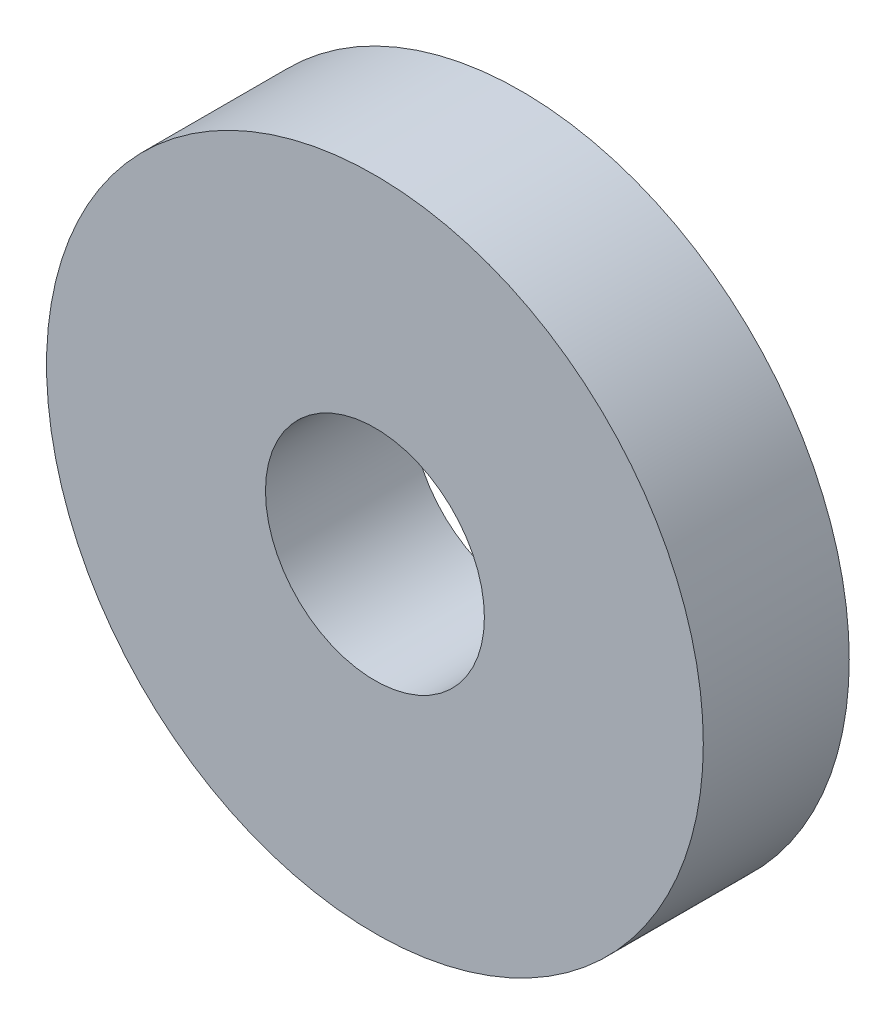
ISO-10303-21;
HEADER;
FILE_DESCRIPTION(('STEP AP214'),'2;1');
FILE_NAME('part.step','',(''),(''),'','','');
FILE_SCHEMA(('AUTOMOTIVE_DESIGN { 1 0 10303 214 1 1 1 1 }'));
ENDSEC;
DATA;
#1=APPLICATION_CONTEXT('core data for automotive mechanical design processes');
#2=APPLICATION_PROTOCOL_DEFINITION('international standard','automotive_design',2000,#1);
#3=PRODUCT_CONTEXT('',#1,'mechanical');
#4=PRODUCT('Part','Part','',(#3));
#5=PRODUCT_RELATED_PRODUCT_CATEGORY('part','',(#4));
#6=PRODUCT_DEFINITION_FORMATION('','',#4);
#7=PRODUCT_DEFINITION_CONTEXT('part definition',#1,'design');
#8=PRODUCT_DEFINITION('design','',#6,#7);
#9=PRODUCT_DEFINITION_SHAPE('','',#8);
#10=(LENGTH_UNIT() NAMED_UNIT(*) SI_UNIT(.MILLI.,.METRE.));
#11=(NAMED_UNIT(*) PLANE_ANGLE_UNIT() SI_UNIT($,.RADIAN.));
#12=(NAMED_UNIT(*) SI_UNIT($,.STERADIAN.) SOLID_ANGLE_UNIT());
#13=UNCERTAINTY_MEASURE_WITH_UNIT(LENGTH_MEASURE(1.E-05),#10,'distance_accuracy_value','');
#14=(GEOMETRIC_REPRESENTATION_CONTEXT(3) GLOBAL_UNCERTAINTY_ASSIGNED_CONTEXT((#13)) GLOBAL_UNIT_ASSIGNED_CONTEXT((#10,
#11,#12)) REPRESENTATION_CONTEXT('',''));
#15=CARTESIAN_POINT('',(0.,0.,0.));
#16=DIRECTION('',(0.,0.,1.));
#17=DIRECTION('',(1.,0.,0.));
#18=AXIS2_PLACEMENT_3D('',#15,#16,#17);
#19=CARTESIAN_POINT('',(0.,0.,2.));
#20=DIRECTION('',(0.,0.,1.));
#21=DIRECTION('',(1.,0.,0.));
#22=AXIS2_PLACEMENT_3D('',#19,#20,#21);
#23=PLANE('',#22);
#24=CARTESIAN_POINT('',(0.,0.,2.));
#25=DIRECTION('',(0.,0.,1.));
#26=DIRECTION('',(1.,0.,0.));
#27=AXIS2_PLACEMENT_3D('',#24,#25,#26);
#28=CIRCLE('',#27,4.5);
#29=CARTESIAN_POINT('',(4.5,0.,2.));
#30=VERTEX_POINT('',#29);
#31=EDGE_CURVE('E10',#30,#30,#28,.T.);
#32=ORIENTED_EDGE('',*,*,#31,.T.);
#33=EDGE_LOOP('',(#32));
#34=FACE_BOUND('',#33,.T.);
#35=CARTESIAN_POINT('',(0.,0.,2.));
#36=DIRECTION('',(0.,0.,1.));
#37=DIRECTION('',(1.,0.,0.));
#38=AXIS2_PLACEMENT_3D('',#35,#36,#37);
#39=CIRCLE('',#38,1.5);
#40=CARTESIAN_POINT('',(1.5,0.,2.));
#41=VERTEX_POINT('',#40);
#42=EDGE_CURVE('E46',#41,#41,#39,.T.);
#43=ORIENTED_EDGE('',*,*,#42,.F.);
#44=EDGE_LOOP('',(#43));
#45=FACE_BOUND('',#44,.T.);
#46=ADVANCED_FACE('F35',(#34,#45),#23,.T.);
#47=CARTESIAN_POINT('',(0.,0.,0.));
#48=DIRECTION('',(0.,0.,1.));
#49=DIRECTION('',(1.,0.,0.));
#50=AXIS2_PLACEMENT_3D('',#47,#48,#49);
#51=PLANE('',#50);
#52=CARTESIAN_POINT('',(0.,0.,0.));
#53=DIRECTION('',(0.,0.,1.));
#54=DIRECTION('',(1.,0.,0.));
#55=AXIS2_PLACEMENT_3D('',#52,#53,#54);
#56=CIRCLE('',#55,4.5);
#57=CARTESIAN_POINT('',(4.5,0.,0.));
#58=VERTEX_POINT('',#57);
#59=EDGE_CURVE('E39',#58,#58,#56,.T.);
#60=ORIENTED_EDGE('',*,*,#59,.F.);
#61=EDGE_LOOP('',(#60));
#62=FACE_BOUND('',#61,.T.);
#63=CARTESIAN_POINT('',(0.,0.,0.));
#64=DIRECTION('',(0.,0.,1.));
#65=DIRECTION('',(1.,0.,0.));
#66=AXIS2_PLACEMENT_3D('',#63,#64,#65);
#67=CIRCLE('',#66,1.5);
#68=CARTESIAN_POINT('',(1.5,0.,0.));
#69=VERTEX_POINT('',#68);
#70=EDGE_CURVE('E48',#69,#69,#67,.T.);
#71=ORIENTED_EDGE('',*,*,#70,.T.);
#72=EDGE_LOOP('',(#71));
#73=FACE_BOUND('',#72,.T.);
#74=ADVANCED_FACE('F58',(#62,#73),#51,.F.);
#75=CARTESIAN_POINT('',(0.,0.,2.));
#76=DIRECTION('',(0.,0.,-1.));
#77=DIRECTION('',(-1.,0.,0.));
#78=AXIS2_PLACEMENT_3D('',#75,#76,#77);
#79=CYLINDRICAL_SURFACE('',#78,4.5);
#80=ORIENTED_EDGE('',*,*,#31,.F.);
#81=EDGE_LOOP('',(#80));
#82=FACE_BOUND('',#81,.T.);
#83=ORIENTED_EDGE('',*,*,#59,.T.);
#84=EDGE_LOOP('',(#83));
#85=FACE_BOUND('',#84,.T.);
#86=ADVANCED_FACE('F37',(#82,#85),#79,.T.);
#87=CARTESIAN_POINT('',(0.,0.,2.));
#88=DIRECTION('',(0.,0.,-1.));
#89=DIRECTION('',(-1.,0.,0.));
#90=AXIS2_PLACEMENT_3D('',#87,#88,#89);
#91=CYLINDRICAL_SURFACE('',#90,1.5);
#92=ORIENTED_EDGE('',*,*,#42,.T.);
#93=EDGE_LOOP('',(#92));
#94=FACE_BOUND('',#93,.T.);
#95=ORIENTED_EDGE('',*,*,#70,.F.);
#96=EDGE_LOOP('',(#95));
#97=FACE_BOUND('',#96,.T.);
#98=ADVANCED_FACE('F54',(#94,#97),#91,.F.);
#99=CLOSED_SHELL('',(#46,#74,#86,#98));
#100=MANIFOLD_SOLID_BREP('B2',#99);
#101=ADVANCED_BREP_SHAPE_REPRESENTATION('',(#18,#100),#14);
#102=SHAPE_DEFINITION_REPRESENTATION(#9,#101);
ENDSEC;
END-ISO-10303-21;
